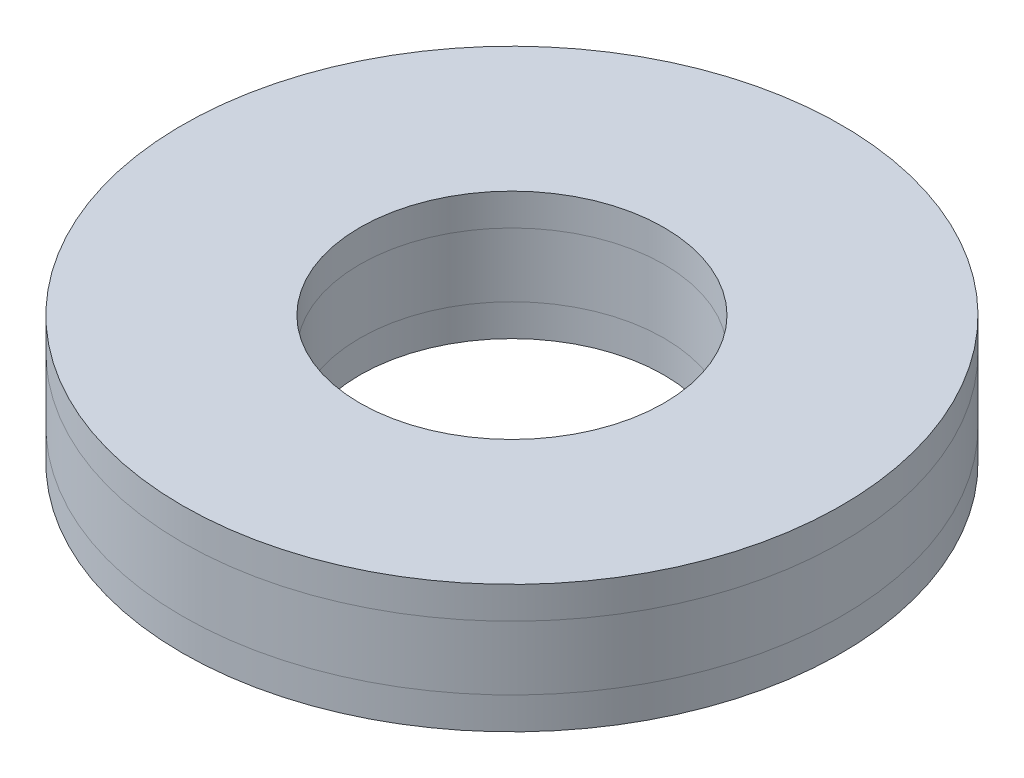
ISO-10303-21;
HEADER;
FILE_DESCRIPTION(('STEP AP214'),'2;1');
FILE_NAME('part.step','',(''),(''),'','','');
FILE_SCHEMA(('AUTOMOTIVE_DESIGN { 1 0 10303 214 1 1 1 1 }'));
ENDSEC;
DATA;
#1=APPLICATION_CONTEXT('core data for automotive mechanical design processes');
#2=APPLICATION_PROTOCOL_DEFINITION('international standard','automotive_design',2000,#1);
#3=PRODUCT_CONTEXT('',#1,'mechanical');
#4=PRODUCT('Part','Part','',(#3));
#5=PRODUCT_RELATED_PRODUCT_CATEGORY('part','',(#4));
#6=PRODUCT_DEFINITION_FORMATION('','',#4);
#7=PRODUCT_DEFINITION_CONTEXT('part definition',#1,'design');
#8=PRODUCT_DEFINITION('design','',#6,#7);
#9=PRODUCT_DEFINITION_SHAPE('','',#8);
#10=(LENGTH_UNIT() NAMED_UNIT(*) SI_UNIT(.MILLI.,.METRE.));
#11=(NAMED_UNIT(*) PLANE_ANGLE_UNIT() SI_UNIT($,.RADIAN.));
#12=(NAMED_UNIT(*) SI_UNIT($,.STERADIAN.) SOLID_ANGLE_UNIT());
#13=UNCERTAINTY_MEASURE_WITH_UNIT(LENGTH_MEASURE(1.E-05),#10,'distance_accuracy_value','');
#14=(GEOMETRIC_REPRESENTATION_CONTEXT(3) GLOBAL_UNCERTAINTY_ASSIGNED_CONTEXT((#13)) GLOBAL_UNIT_ASSIGNED_CONTEXT((#10,
#11,#12)) REPRESENTATION_CONTEXT('',''));
#15=CARTESIAN_POINT('',(0.,0.,0.));
#16=DIRECTION('',(0.,0.,1.));
#17=DIRECTION('',(1.,0.,0.));
#18=AXIS2_PLACEMENT_3D('',#15,#16,#17);
#19=CARTESIAN_POINT('',(0.,4.,0.));
#20=DIRECTION('',(0.,1.,0.));
#21=DIRECTION('',(0.,0.,1.));
#22=AXIS2_PLACEMENT_3D('',#19,#20,#21);
#23=PLANE('',#22);
#24=CARTESIAN_POINT('',(0.,4.,0.));
#25=DIRECTION('',(0.,1.,0.));
#26=DIRECTION('',(0.,0.,1.));
#27=AXIS2_PLACEMENT_3D('',#24,#25,#26);
#28=CIRCLE('',#27,10.32);
#29=CARTESIAN_POINT('',(0.,4.,10.32));
#30=VERTEX_POINT('',#29);
#31=EDGE_CURVE('E11',#30,#30,#28,.T.);
#32=ORIENTED_EDGE('',*,*,#31,.T.);
#33=EDGE_LOOP('',(#32));
#34=FACE_BOUND('',#33,.T.);
#35=CARTESIAN_POINT('',(0.,4.,0.));
#36=DIRECTION('',(0.,1.,0.));
#37=DIRECTION('',(0.,0.,1.));
#38=AXIS2_PLACEMENT_3D('',#35,#36,#37);
#39=CIRCLE('',#38,4.7625);
#40=CARTESIAN_POINT('',(0.,4.,4.7625));
#41=VERTEX_POINT('',#40);
#42=EDGE_CURVE('E57',#41,#41,#39,.T.);
#43=ORIENTED_EDGE('',*,*,#42,.F.);
#44=EDGE_LOOP('',(#43));
#45=FACE_BOUND('',#44,.T.);
#46=ADVANCED_FACE('F46',(#34,#45),#23,.T.);
#47=CARTESIAN_POINT('',(0.,3.,0.));
#48=DIRECTION('',(0.,1.,0.));
#49=DIRECTION('',(0.,0.,1.));
#50=AXIS2_PLACEMENT_3D('',#47,#48,#49);
#51=PLANE('',#50);
#52=CARTESIAN_POINT('',(0.,3.,0.));
#53=DIRECTION('',(0.,1.,0.));
#54=DIRECTION('',(0.,0.,1.));
#55=AXIS2_PLACEMENT_3D('',#52,#53,#54);
#56=CIRCLE('',#55,10.32);
#57=CARTESIAN_POINT('',(0.,3.,10.32));
#58=VERTEX_POINT('',#57);
#59=EDGE_CURVE('E50',#58,#58,#56,.T.);
#60=ORIENTED_EDGE('',*,*,#59,.F.);
#61=EDGE_LOOP('',(#60));
#62=FACE_BOUND('',#61,.T.);
#63=CARTESIAN_POINT('',(0.,3.,0.));
#64=DIRECTION('',(0.,1.,0.));
#65=DIRECTION('',(0.,0.,1.));
#66=AXIS2_PLACEMENT_3D('',#63,#64,#65);
#67=CIRCLE('',#66,4.7625);
#68=CARTESIAN_POINT('',(0.,3.,4.7625));
#69=VERTEX_POINT('',#68);
#70=EDGE_CURVE('E59',#69,#69,#67,.T.);
#71=ORIENTED_EDGE('',*,*,#70,.T.);
#72=EDGE_LOOP('',(#71));
#73=FACE_BOUND('',#72,.T.);
#74=ADVANCED_FACE('F69',(#62,#73),#51,.F.);
#75=CARTESIAN_POINT('',(0.,4.,0.));
#76=DIRECTION('',(0.,-1.,0.));
#77=DIRECTION('',(0.,0.,-1.));
#78=AXIS2_PLACEMENT_3D('',#75,#76,#77);
#79=CYLINDRICAL_SURFACE('',#78,10.32);
#80=ORIENTED_EDGE('',*,*,#31,.F.);
#81=EDGE_LOOP('',(#80));
#82=FACE_BOUND('',#81,.T.);
#83=ORIENTED_EDGE('',*,*,#59,.T.);
#84=EDGE_LOOP('',(#83));
#85=FACE_BOUND('',#84,.T.);
#86=ADVANCED_FACE('F48',(#82,#85),#79,.T.);
#87=CARTESIAN_POINT('',(0.,4.,0.));
#88=DIRECTION('',(0.,-1.,0.));
#89=DIRECTION('',(0.,0.,-1.));
#90=AXIS2_PLACEMENT_3D('',#87,#88,#89);
#91=CYLINDRICAL_SURFACE('',#90,4.7625);
#92=ORIENTED_EDGE('',*,*,#42,.T.);
#93=EDGE_LOOP('',(#92));
#94=FACE_BOUND('',#93,.T.);
#95=ORIENTED_EDGE('',*,*,#70,.F.);
#96=EDGE_LOOP('',(#95));
#97=FACE_BOUND('',#96,.T.);
#98=ADVANCED_FACE('F65',(#94,#97),#91,.F.);
#99=CLOSED_SHELL('',(#46,#74,#86,#98));
#100=MANIFOLD_SOLID_BREP('B2',#99);
#101=CARTESIAN_POINT('',(0.,3.,0.));
#102=DIRECTION('',(0.,1.,0.));
#103=DIRECTION('',(0.,0.,1.));
#104=AXIS2_PLACEMENT_3D('',#101,#102,#103);
#105=PLANE('',#104);
#106=CARTESIAN_POINT('',(0.,3.,0.));
#107=DIRECTION('',(0.,1.,0.));
#108=DIRECTION('',(0.,0.,1.));
#109=AXIS2_PLACEMENT_3D('',#106,#107,#108);
#110=CIRCLE('',#109,10.32);
#111=CARTESIAN_POINT('',(0.,3.,10.32));
#112=VERTEX_POINT('',#111);
#113=EDGE_CURVE('E45',#112,#112,#110,.T.);
#114=ORIENTED_EDGE('',*,*,#113,.T.);
#115=EDGE_LOOP('',(#114));
#116=FACE_BOUND('',#115,.T.);
#117=CARTESIAN_POINT('',(0.,3.,0.));
#118=DIRECTION('',(0.,1.,0.));
#119=DIRECTION('',(0.,0.,1.));
#120=AXIS2_PLACEMENT_3D('',#117,#118,#119);
#121=CIRCLE('',#120,4.7625);
#122=CARTESIAN_POINT('',(0.,3.,4.7625));
#123=VERTEX_POINT('',#122);
#124=EDGE_CURVE('E128',#123,#123,#121,.T.);
#125=ORIENTED_EDGE('',*,*,#124,.F.);
#126=EDGE_LOOP('',(#125));
#127=FACE_BOUND('',#126,.T.);
#128=ADVANCED_FACE('F115',(#116,#127),#105,.T.);
#129=CARTESIAN_POINT('',(0.,1.,0.));
#130=DIRECTION('',(0.,1.,0.));
#131=DIRECTION('',(0.,0.,1.));
#132=AXIS2_PLACEMENT_3D('',#129,#130,#131);
#133=PLANE('',#132);
#134=CARTESIAN_POINT('',(0.,1.,0.));
#135=DIRECTION('',(0.,1.,0.));
#136=DIRECTION('',(0.,0.,1.));
#137=AXIS2_PLACEMENT_3D('',#134,#135,#136);
#138=CIRCLE('',#137,10.32);
#139=CARTESIAN_POINT('',(0.,1.,10.32));
#140=VERTEX_POINT('',#139);
#141=EDGE_CURVE('E119',#140,#140,#138,.T.);
#142=ORIENTED_EDGE('',*,*,#141,.F.);
#143=EDGE_LOOP('',(#142));
#144=FACE_BOUND('',#143,.T.);
#145=CARTESIAN_POINT('',(0.,1.,0.));
#146=DIRECTION('',(0.,1.,0.));
#147=DIRECTION('',(0.,0.,1.));
#148=AXIS2_PLACEMENT_3D('',#145,#146,#147);
#149=CIRCLE('',#148,4.7625);
#150=CARTESIAN_POINT('',(0.,1.,4.7625));
#151=VERTEX_POINT('',#150);
#152=EDGE_CURVE('E130',#151,#151,#149,.T.);
#153=ORIENTED_EDGE('',*,*,#152,.T.);
#154=EDGE_LOOP('',(#153));
#155=FACE_BOUND('',#154,.T.);
#156=ADVANCED_FACE('F142',(#144,#155),#133,.F.);
#157=CARTESIAN_POINT('',(0.,3.,0.));
#158=DIRECTION('',(0.,-1.,0.));
#159=DIRECTION('',(0.,0.,-1.));
#160=AXIS2_PLACEMENT_3D('',#157,#158,#159);
#161=CYLINDRICAL_SURFACE('',#160,10.32);
#162=ORIENTED_EDGE('',*,*,#113,.F.);
#163=EDGE_LOOP('',(#162));
#164=FACE_BOUND('',#163,.T.);
#165=ORIENTED_EDGE('',*,*,#141,.T.);
#166=EDGE_LOOP('',(#165));
#167=FACE_BOUND('',#166,.T.);
#168=ADVANCED_FACE('F117',(#164,#167),#161,.T.);
#169=CARTESIAN_POINT('',(0.,3.,0.));
#170=DIRECTION('',(0.,-1.,0.));
#171=DIRECTION('',(0.,0.,-1.));
#172=AXIS2_PLACEMENT_3D('',#169,#170,#171);
#173=CYLINDRICAL_SURFACE('',#172,4.7625);
#174=ORIENTED_EDGE('',*,*,#124,.T.);
#175=EDGE_LOOP('',(#174));
#176=FACE_BOUND('',#175,.T.);
#177=ORIENTED_EDGE('',*,*,#152,.F.);
#178=EDGE_LOOP('',(#177));
#179=FACE_BOUND('',#178,.T.);
#180=ADVANCED_FACE('F138',(#176,#179),#173,.F.);
#181=CLOSED_SHELL('',(#128,#156,#168,#180));
#182=MANIFOLD_SOLID_BREP('B6',#181);
#183=CARTESIAN_POINT('',(0.,1.,0.));
#184=DIRECTION('',(0.,1.,0.));
#185=DIRECTION('',(0.,0.,1.));
#186=AXIS2_PLACEMENT_3D('',#183,#184,#185);
#187=PLANE('',#186);
#188=CARTESIAN_POINT('',(0.,1.,0.));
#189=DIRECTION('',(0.,1.,0.));
#190=DIRECTION('',(0.,0.,1.));
#191=AXIS2_PLACEMENT_3D('',#188,#189,#190);
#192=CIRCLE('',#191,10.32);
#193=CARTESIAN_POINT('',(0.,1.,10.32));
#194=VERTEX_POINT('',#193);
#195=EDGE_CURVE('E114',#194,#194,#192,.T.);
#196=ORIENTED_EDGE('',*,*,#195,.T.);
#197=EDGE_LOOP('',(#196));
#198=FACE_BOUND('',#197,.T.);
#199=CARTESIAN_POINT('',(0.,1.,0.));
#200=DIRECTION('',(0.,1.,0.));
#201=DIRECTION('',(0.,0.,1.));
#202=AXIS2_PLACEMENT_3D('',#199,#200,#201);
#203=CIRCLE('',#202,4.7625);
#204=CARTESIAN_POINT('',(0.,1.,4.7625));
#205=VERTEX_POINT('',#204);
#206=EDGE_CURVE('E192',#205,#205,#203,.T.);
#207=ORIENTED_EDGE('',*,*,#206,.F.);
#208=EDGE_LOOP('',(#207));
#209=FACE_BOUND('',#208,.T.);
#210=ADVANCED_FACE('F181',(#198,#209),#187,.T.);
#211=CARTESIAN_POINT('',(0.,0.,0.));
#212=DIRECTION('',(0.,1.,0.));
#213=DIRECTION('',(0.,0.,1.));
#214=AXIS2_PLACEMENT_3D('',#211,#212,#213);
#215=PLANE('',#214);
#216=CARTESIAN_POINT('',(0.,0.,0.));
#217=DIRECTION('',(0.,1.,0.));
#218=DIRECTION('',(0.,0.,1.));
#219=AXIS2_PLACEMENT_3D('',#216,#217,#218);
#220=CIRCLE('',#219,10.32);
#221=CARTESIAN_POINT('',(0.,0.,10.32));
#222=VERTEX_POINT('',#221);
#223=EDGE_CURVE('E185',#222,#222,#220,.T.);
#224=ORIENTED_EDGE('',*,*,#223,.F.);
#225=EDGE_LOOP('',(#224));
#226=FACE_BOUND('',#225,.T.);
#227=CARTESIAN_POINT('',(0.,0.,0.));
#228=DIRECTION('',(0.,1.,0.));
#229=DIRECTION('',(0.,0.,1.));
#230=AXIS2_PLACEMENT_3D('',#227,#228,#229);
#231=CIRCLE('',#230,4.7625);
#232=CARTESIAN_POINT('',(0.,0.,4.7625));
#233=VERTEX_POINT('',#232);
#234=EDGE_CURVE('E194',#233,#233,#231,.T.);
#235=ORIENTED_EDGE('',*,*,#234,.T.);
#236=EDGE_LOOP('',(#235));
#237=FACE_BOUND('',#236,.T.);
#238=ADVANCED_FACE('F204',(#226,#237),#215,.F.);
#239=CARTESIAN_POINT('',(0.,1.,0.));
#240=DIRECTION('',(0.,-1.,0.));
#241=DIRECTION('',(0.,0.,-1.));
#242=AXIS2_PLACEMENT_3D('',#239,#240,#241);
#243=CYLINDRICAL_SURFACE('',#242,10.32);
#244=ORIENTED_EDGE('',*,*,#195,.F.);
#245=EDGE_LOOP('',(#244));
#246=FACE_BOUND('',#245,.T.);
#247=ORIENTED_EDGE('',*,*,#223,.T.);
#248=EDGE_LOOP('',(#247));
#249=FACE_BOUND('',#248,.T.);
#250=ADVANCED_FACE('F183',(#246,#249),#243,.T.);
#251=CARTESIAN_POINT('',(0.,1.,0.));
#252=DIRECTION('',(0.,-1.,0.));
#253=DIRECTION('',(0.,0.,-1.));
#254=AXIS2_PLACEMENT_3D('',#251,#252,#253);
#255=CYLINDRICAL_SURFACE('',#254,4.7625);
#256=ORIENTED_EDGE('',*,*,#206,.T.);
#257=EDGE_LOOP('',(#256));
#258=FACE_BOUND('',#257,.T.);
#259=ORIENTED_EDGE('',*,*,#234,.F.);
#260=EDGE_LOOP('',(#259));
#261=FACE_BOUND('',#260,.T.);
#262=ADVANCED_FACE('F200',(#258,#261),#255,.F.);
#263=CLOSED_SHELL('',(#210,#238,#250,#262));
#264=MANIFOLD_SOLID_BREP('B40',#263);
#265=ADVANCED_BREP_SHAPE_REPRESENTATION('',(#18,#100,#182,#264),#14);
#266=SHAPE_DEFINITION_REPRESENTATION(#9,#265);
ENDSEC;
END-ISO-10303-21;
